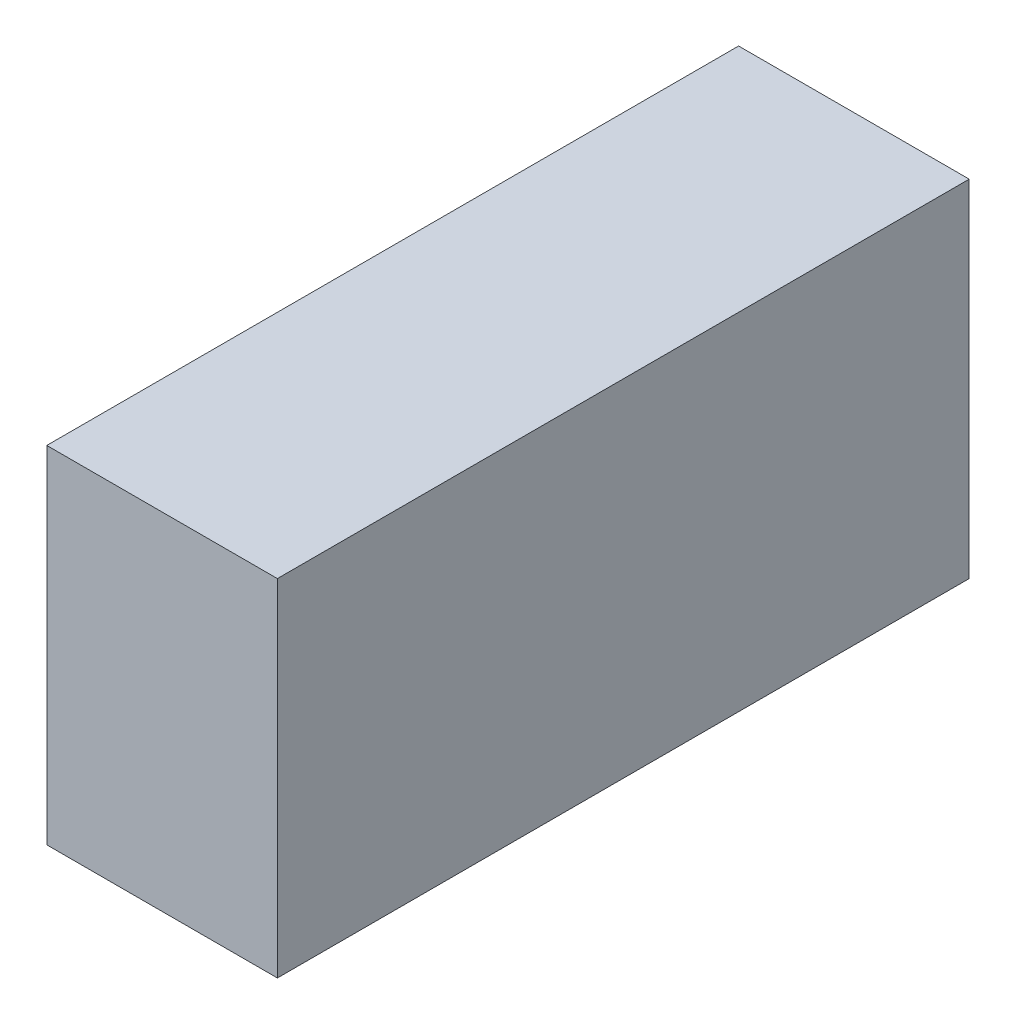
ISO-10303-21;
HEADER;
FILE_DESCRIPTION(('STEP AP214'),'2;1');
FILE_NAME('part.step','',(''),(''),'','','');
FILE_SCHEMA(('AUTOMOTIVE_DESIGN { 1 0 10303 214 1 1 1 1 }'));
ENDSEC;
DATA;
#1=APPLICATION_CONTEXT('core data for automotive mechanical design processes');
#2=APPLICATION_PROTOCOL_DEFINITION('international standard','automotive_design',2000,#1);
#3=PRODUCT_CONTEXT('',#1,'mechanical');
#4=PRODUCT('Part','Part','',(#3));
#5=PRODUCT_RELATED_PRODUCT_CATEGORY('part','',(#4));
#6=PRODUCT_DEFINITION_FORMATION('','',#4);
#7=PRODUCT_DEFINITION_CONTEXT('part definition',#1,'design');
#8=PRODUCT_DEFINITION('design','',#6,#7);
#9=PRODUCT_DEFINITION_SHAPE('','',#8);
#10=(LENGTH_UNIT() NAMED_UNIT(*) SI_UNIT(.MILLI.,.METRE.));
#11=(NAMED_UNIT(*) PLANE_ANGLE_UNIT() SI_UNIT($,.RADIAN.));
#12=(NAMED_UNIT(*) SI_UNIT($,.STERADIAN.) SOLID_ANGLE_UNIT());
#13=UNCERTAINTY_MEASURE_WITH_UNIT(LENGTH_MEASURE(1.E-05),#10,'distance_accuracy_value','');
#14=(GEOMETRIC_REPRESENTATION_CONTEXT(3) GLOBAL_UNCERTAINTY_ASSIGNED_CONTEXT((#13)) GLOBAL_UNIT_ASSIGNED_CONTEXT((#10,
#11,#12)) REPRESENTATION_CONTEXT('',''));
#15=CARTESIAN_POINT('',(0.,0.,0.));
#16=DIRECTION('',(0.,0.,1.));
#17=DIRECTION('',(1.,0.,0.));
#18=AXIS2_PLACEMENT_3D('',#15,#16,#17);
#19=CARTESIAN_POINT('',(10.,0.,0.));
#20=DIRECTION('',(0.,0.,-1.));
#21=DIRECTION('',(-1.,0.,0.));
#22=AXIS2_PLACEMENT_3D('',#19,#20,#21);
#23=PLANE('',#22);
#24=DIRECTION('',(0.,-1.,0.));
#25=VECTOR('',#24,1.);
#26=CARTESIAN_POINT('',(0.,0.,0.));
#27=LINE('',#26,#25);
#28=CARTESIAN_POINT('',(0.,15.,0.));
#29=VERTEX_POINT('',#28);
#30=CARTESIAN_POINT('',(0.,0.,0.));
#31=VERTEX_POINT('',#30);
#32=EDGE_CURVE('E96',#29,#31,#27,.T.);
#33=ORIENTED_EDGE('',*,*,#32,.T.);
#34=DIRECTION('',(-1.,0.,0.));
#35=VECTOR('',#34,1.);
#36=CARTESIAN_POINT('',(10.,0.,0.));
#37=LINE('',#36,#35);
#38=CARTESIAN_POINT('',(10.,0.,0.));
#39=VERTEX_POINT('',#38);
#40=EDGE_CURVE('E11',#39,#31,#37,.T.);
#41=ORIENTED_EDGE('',*,*,#40,.F.);
#42=DIRECTION('',(0.,-1.,0.));
#43=VECTOR('',#42,1.);
#44=CARTESIAN_POINT('',(10.,0.,0.));
#45=LINE('',#44,#43);
#46=CARTESIAN_POINT('',(10.,15.,0.));
#47=VERTEX_POINT('',#46);
#48=EDGE_CURVE('E84',#47,#39,#45,.T.);
#49=ORIENTED_EDGE('',*,*,#48,.F.);
#50=DIRECTION('',(-1.,0.,0.));
#51=VECTOR('',#50,1.);
#52=CARTESIAN_POINT('',(10.,15.,0.));
#53=LINE('',#52,#51);
#54=EDGE_CURVE('E92',#47,#29,#53,.T.);
#55=ORIENTED_EDGE('',*,*,#54,.T.);
#56=EDGE_LOOP('',(#33,#41,#49,#55));
#57=FACE_BOUND('',#56,.T.);
#58=ADVANCED_FACE('F33',(#57),#23,.F.);
#59=CARTESIAN_POINT('',(10.,0.,0.));
#60=DIRECTION('',(0.,1.,0.));
#61=DIRECTION('',(0.,0.,1.));
#62=AXIS2_PLACEMENT_3D('',#59,#60,#61);
#63=PLANE('',#62);
#64=DIRECTION('',(0.,0.,-1.));
#65=VECTOR('',#64,1.);
#66=CARTESIAN_POINT('',(0.,0.,0.));
#67=LINE('',#66,#65);
#68=CARTESIAN_POINT('',(0.,0.,-30.));
#69=VERTEX_POINT('',#68);
#70=EDGE_CURVE('E88',#31,#69,#67,.T.);
#71=ORIENTED_EDGE('',*,*,#70,.T.);
#72=DIRECTION('',(-1.,0.,0.));
#73=VECTOR('',#72,1.);
#74=CARTESIAN_POINT('',(10.,0.,-30.));
#75=LINE('',#74,#73);
#76=CARTESIAN_POINT('',(10.,0.,-30.));
#77=VERTEX_POINT('',#76);
#78=EDGE_CURVE('E41',#77,#69,#75,.T.);
#79=ORIENTED_EDGE('',*,*,#78,.F.);
#80=DIRECTION('',(0.,0.,-1.));
#81=VECTOR('',#80,1.);
#82=CARTESIAN_POINT('',(10.,0.,0.));
#83=LINE('',#82,#81);
#84=EDGE_CURVE('E79',#39,#77,#83,.T.);
#85=ORIENTED_EDGE('',*,*,#84,.F.);
#86=ORIENTED_EDGE('',*,*,#40,.T.);
#87=EDGE_LOOP('',(#71,#79,#85,#86));
#88=FACE_BOUND('',#87,.T.);
#89=ADVANCED_FACE('F87',(#88),#63,.F.);
#90=CARTESIAN_POINT('',(10.,0.,-30.));
#91=DIRECTION('',(0.,0.,1.));
#92=DIRECTION('',(1.,0.,0.));
#93=AXIS2_PLACEMENT_3D('',#90,#91,#92);
#94=PLANE('',#93);
#95=DIRECTION('',(0.,1.,0.));
#96=VECTOR('',#95,1.);
#97=CARTESIAN_POINT('',(0.,0.,-30.));
#98=LINE('',#97,#96);
#99=CARTESIAN_POINT('',(0.,15.,-30.));
#100=VERTEX_POINT('',#99);
#101=EDGE_CURVE('E66',#69,#100,#98,.T.);
#102=ORIENTED_EDGE('',*,*,#101,.T.);
#103=DIRECTION('',(-1.,0.,0.));
#104=VECTOR('',#103,1.);
#105=CARTESIAN_POINT('',(10.,15.,-30.));
#106=LINE('',#105,#104);
#107=CARTESIAN_POINT('',(10.,15.,-30.));
#108=VERTEX_POINT('',#107);
#109=EDGE_CURVE('E89',#108,#100,#106,.T.);
#110=ORIENTED_EDGE('',*,*,#109,.F.);
#111=DIRECTION('',(0.,1.,0.));
#112=VECTOR('',#111,1.);
#113=CARTESIAN_POINT('',(10.,0.,-30.));
#114=LINE('',#113,#112);
#115=EDGE_CURVE('E82',#77,#108,#114,.T.);
#116=ORIENTED_EDGE('',*,*,#115,.F.);
#117=ORIENTED_EDGE('',*,*,#78,.T.);
#118=EDGE_LOOP('',(#102,#110,#116,#117));
#119=FACE_BOUND('',#118,.T.);
#120=ADVANCED_FACE('F90',(#119),#94,.F.);
#121=CARTESIAN_POINT('',(10.,15.,0.));
#122=DIRECTION('',(0.,-1.,0.));
#123=DIRECTION('',(0.,0.,-1.));
#124=AXIS2_PLACEMENT_3D('',#121,#122,#123);
#125=PLANE('',#124);
#126=DIRECTION('',(0.,0.,1.));
#127=VECTOR('',#126,1.);
#128=CARTESIAN_POINT('',(0.,15.,0.));
#129=LINE('',#128,#127);
#130=EDGE_CURVE('E72',#100,#29,#129,.T.);
#131=ORIENTED_EDGE('',*,*,#130,.T.);
#132=ORIENTED_EDGE('',*,*,#54,.F.);
#133=DIRECTION('',(0.,0.,1.));
#134=VECTOR('',#133,1.);
#135=CARTESIAN_POINT('',(10.,15.,0.));
#136=LINE('',#135,#134);
#137=EDGE_CURVE('E49',#108,#47,#136,.T.);
#138=ORIENTED_EDGE('',*,*,#137,.F.);
#139=ORIENTED_EDGE('',*,*,#109,.T.);
#140=EDGE_LOOP('',(#131,#132,#138,#139));
#141=FACE_BOUND('',#140,.T.);
#142=ADVANCED_FACE('F103',(#141),#125,.F.);
#143=CARTESIAN_POINT('',(10.,15.,0.));
#144=DIRECTION('',(-1.,0.,0.));
#145=DIRECTION('',(0.,0.,1.));
#146=AXIS2_PLACEMENT_3D('',#143,#144,#145);
#147=PLANE('',#146);
#148=ORIENTED_EDGE('',*,*,#48,.T.);
#149=ORIENTED_EDGE('',*,*,#84,.T.);
#150=ORIENTED_EDGE('',*,*,#115,.T.);
#151=ORIENTED_EDGE('',*,*,#137,.T.);
#152=EDGE_LOOP('',(#148,#149,#150,#151));
#153=FACE_BOUND('',#152,.T.);
#154=ADVANCED_FACE('F80',(#153),#147,.F.);
#155=CARTESIAN_POINT('',(0.,15.,0.));
#156=DIRECTION('',(-1.,0.,0.));
#157=DIRECTION('',(0.,0.,1.));
#158=AXIS2_PLACEMENT_3D('',#155,#156,#157);
#159=PLANE('',#158);
#160=ORIENTED_EDGE('',*,*,#32,.F.);
#161=ORIENTED_EDGE('',*,*,#130,.F.);
#162=ORIENTED_EDGE('',*,*,#101,.F.);
#163=ORIENTED_EDGE('',*,*,#70,.F.);
#164=EDGE_LOOP('',(#160,#161,#162,#163));
#165=FACE_BOUND('',#164,.T.);
#166=ADVANCED_FACE('F106',(#165),#159,.T.);
#167=CLOSED_SHELL('',(#58,#89,#120,#142,#154,#166));
#168=MANIFOLD_SOLID_BREP('B2',#167);
#169=ADVANCED_BREP_SHAPE_REPRESENTATION('',(#18,#168),#14);
#170=SHAPE_DEFINITION_REPRESENTATION(#9,#169);
ENDSEC;
END-ISO-10303-21;
